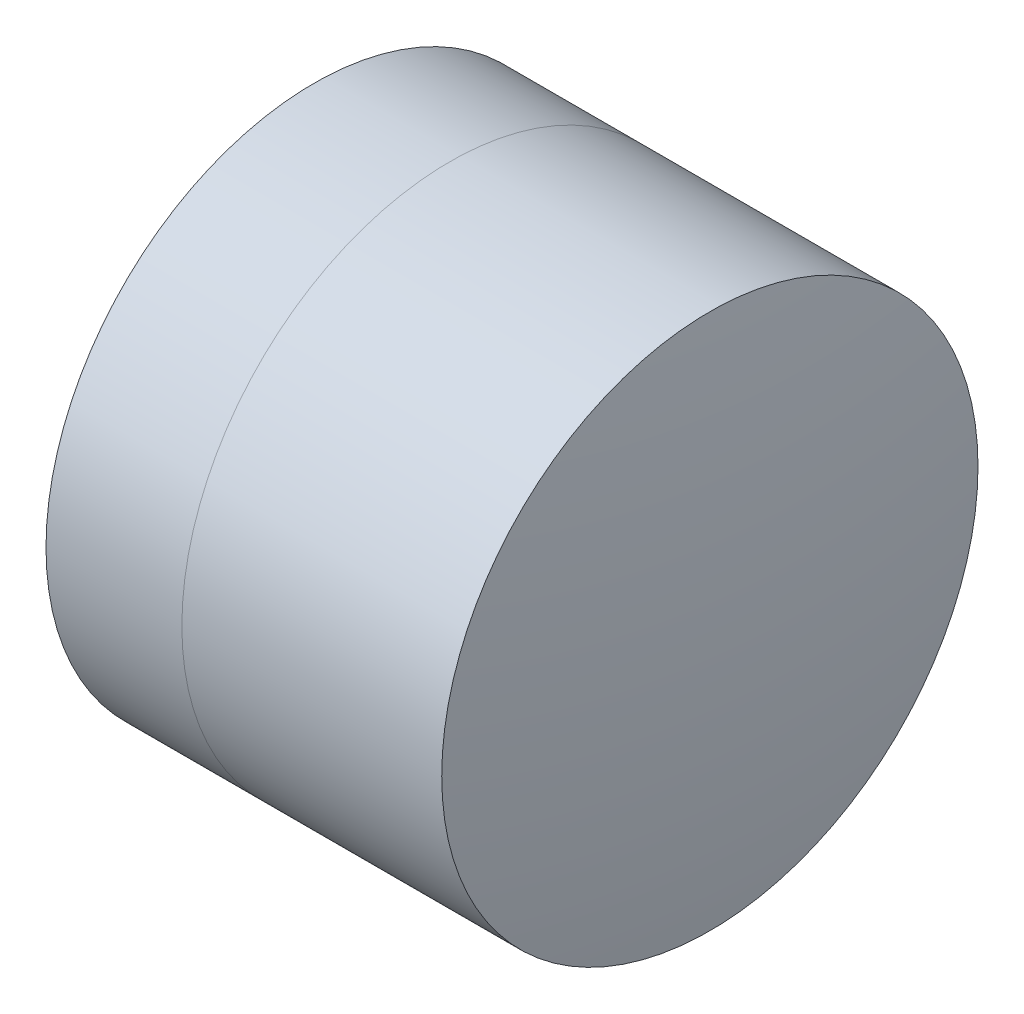
ISO-10303-21;
HEADER;
FILE_DESCRIPTION(('STEP AP214'),'2;1');
FILE_NAME('part.step','',(''),(''),'','','');
FILE_SCHEMA(('AUTOMOTIVE_DESIGN { 1 0 10303 214 1 1 1 1 }'));
ENDSEC;
DATA;
#1=APPLICATION_CONTEXT('core data for automotive mechanical design processes');
#2=APPLICATION_PROTOCOL_DEFINITION('international standard','automotive_design',2000,#1);
#3=PRODUCT_CONTEXT('',#1,'mechanical');
#4=PRODUCT('Part','Part','',(#3));
#5=PRODUCT_RELATED_PRODUCT_CATEGORY('part','',(#4));
#6=PRODUCT_DEFINITION_FORMATION('','',#4);
#7=PRODUCT_DEFINITION_CONTEXT('part definition',#1,'design');
#8=PRODUCT_DEFINITION('design','',#6,#7);
#9=PRODUCT_DEFINITION_SHAPE('','',#8);
#10=(LENGTH_UNIT() NAMED_UNIT(*) SI_UNIT(.MILLI.,.METRE.));
#11=(NAMED_UNIT(*) PLANE_ANGLE_UNIT() SI_UNIT($,.RADIAN.));
#12=(NAMED_UNIT(*) SI_UNIT($,.STERADIAN.) SOLID_ANGLE_UNIT());
#13=UNCERTAINTY_MEASURE_WITH_UNIT(LENGTH_MEASURE(1.E-05),#10,'distance_accuracy_value','');
#14=(GEOMETRIC_REPRESENTATION_CONTEXT(3) GLOBAL_UNCERTAINTY_ASSIGNED_CONTEXT((#13)) GLOBAL_UNIT_ASSIGNED_CONTEXT((#10,
#11,#12)) REPRESENTATION_CONTEXT('',''));
#15=CARTESIAN_POINT('',(0.,0.,0.));
#16=DIRECTION('',(0.,0.,1.));
#17=DIRECTION('',(1.,0.,0.));
#18=AXIS2_PLACEMENT_3D('',#15,#16,#17);
#19=CARTESIAN_POINT('',(0.178214333061158,0.,0.));
#20=DIRECTION('',(-1.,0.,0.));
#21=DIRECTION('',(0.,0.,1.));
#22=AXIS2_PLACEMENT_3D('',#19,#20,#21);
#23=SPHERICAL_SURFACE('',#22,3.9);
#24=CARTESIAN_POINT('',(3.17154024248031,0.,0.));
#25=DIRECTION('',(-1.,0.,0.));
#26=DIRECTION('',(0.,0.,1.));
#27=AXIS2_PLACEMENT_3D('',#24,#25,#26);
#28=CIRCLE('',#27,2.5);
#29=CARTESIAN_POINT('',(3.17154024248031,0.,2.5));
#30=VERTEX_POINT('',#29);
#31=EDGE_CURVE('E11',#30,#30,#28,.T.);
#32=ORIENTED_EDGE('',*,*,#31,.T.);
#33=EDGE_LOOP('',(#32));
#34=FACE_BOUND('',#33,.T.);
#35=ADVANCED_FACE('F47',(#34),#23,.F.);
#36=CARTESIAN_POINT('',(-0.551919992657797,0.,0.));
#37=DIRECTION('',(-1.,0.,0.));
#38=DIRECTION('',(0.,0.,1.));
#39=AXIS2_PLACEMENT_3D('',#36,#37,#38);
#40=CYLINDRICAL_SURFACE('',#39,2.5);
#41=CARTESIAN_POINT('',(5.59447869609356,0.,0.));
#42=DIRECTION('',(-1.,0.,0.));
#43=DIRECTION('',(0.,0.,1.));
#44=AXIS2_PLACEMENT_3D('',#41,#42,#43);
#45=CIRCLE('',#44,2.5);
#46=CARTESIAN_POINT('',(5.59447869609356,0.,2.5));
#47=VERTEX_POINT('',#46);
#48=EDGE_CURVE('E53',#47,#47,#45,.T.);
#49=ORIENTED_EDGE('',*,*,#48,.T.);
#50=EDGE_LOOP('',(#49));
#51=FACE_BOUND('',#50,.T.);
#52=ORIENTED_EDGE('',*,*,#31,.F.);
#53=EDGE_LOOP('',(#52));
#54=FACE_BOUND('',#53,.T.);
#55=ADVANCED_FACE('F59',(#51,#54),#40,.T.);
#56=CARTESIAN_POINT('',(-11.3217856669388,0.,0.));
#57=DIRECTION('',(-1.,0.,0.));
#58=DIRECTION('',(0.,0.,1.));
#59=AXIS2_PLACEMENT_3D('',#56,#57,#58);
#60=SPHERICAL_SURFACE('',#59,17.1);
#61=ORIENTED_EDGE('',*,*,#48,.F.);
#62=EDGE_LOOP('',(#61));
#63=FACE_BOUND('',#62,.T.);
#64=ADVANCED_FACE('F62',(#63),#60,.T.);
#65=CLOSED_SHELL('',(#35,#55,#64));
#66=MANIFOLD_SOLID_BREP('B2',#65);
#67=CARTESIAN_POINT('',(6.57821433306116,0.,0.));
#68=DIRECTION('',(-1.,0.,0.));
#69=DIRECTION('',(0.,0.,1.));
#70=AXIS2_PLACEMENT_3D('',#67,#68,#69);
#71=SPHERICAL_SURFACE('',#70,5.3);
#72=CARTESIAN_POINT('',(1.90488575484199,0.,0.));
#73=DIRECTION('',(-1.,0.,0.));
#74=DIRECTION('',(0.,0.,1.));
#75=AXIS2_PLACEMENT_3D('',#72,#73,#74);
#76=CIRCLE('',#75,2.5);
#77=CARTESIAN_POINT('',(1.90488575484199,0.,2.5));
#78=VERTEX_POINT('',#77);
#79=EDGE_CURVE('E46',#78,#78,#76,.T.);
#80=ORIENTED_EDGE('',*,*,#79,.T.);
#81=EDGE_LOOP('',(#80));
#82=FACE_BOUND('',#81,.T.);
#83=ADVANCED_FACE('F88',(#82),#71,.T.);
#84=CARTESIAN_POINT('',(-0.816062176165804,0.,0.));
#85=DIRECTION('',(-1.,0.,0.));
#86=DIRECTION('',(0.,0.,1.));
#87=AXIS2_PLACEMENT_3D('',#84,#85,#86);
#88=CYLINDRICAL_SURFACE('',#87,2.5);
#89=CARTESIAN_POINT('',(3.17154024248031,0.,0.));
#90=DIRECTION('',(-1.,0.,0.));
#91=DIRECTION('',(0.,0.,1.));
#92=AXIS2_PLACEMENT_3D('',#89,#90,#91);
#93=CIRCLE('',#92,2.5);
#94=CARTESIAN_POINT('',(3.17154024248031,0.,2.5));
#95=VERTEX_POINT('',#94);
#96=EDGE_CURVE('E94',#95,#95,#93,.T.);
#97=ORIENTED_EDGE('',*,*,#96,.T.);
#98=EDGE_LOOP('',(#97));
#99=FACE_BOUND('',#98,.T.);
#100=ORIENTED_EDGE('',*,*,#79,.F.);
#101=EDGE_LOOP('',(#100));
#102=FACE_BOUND('',#101,.T.);
#103=ADVANCED_FACE('F100',(#99,#102),#88,.T.);
#104=CARTESIAN_POINT('',(0.178214333061158,0.,0.));
#105=DIRECTION('',(-1.,0.,0.));
#106=DIRECTION('',(0.,0.,1.));
#107=AXIS2_PLACEMENT_3D('',#104,#105,#106);
#108=SPHERICAL_SURFACE('',#107,3.9);
#109=ORIENTED_EDGE('',*,*,#96,.F.);
#110=EDGE_LOOP('',(#109));
#111=FACE_BOUND('',#110,.T.);
#112=ADVANCED_FACE('F103',(#111),#108,.T.);
#113=CLOSED_SHELL('',(#83,#103,#112));
#114=MANIFOLD_SOLID_BREP('B6',#113);
#115=ADVANCED_BREP_SHAPE_REPRESENTATION('',(#18,#66,#114),#14);
#116=SHAPE_DEFINITION_REPRESENTATION(#9,#115);
ENDSEC;
END-ISO-10303-21;
